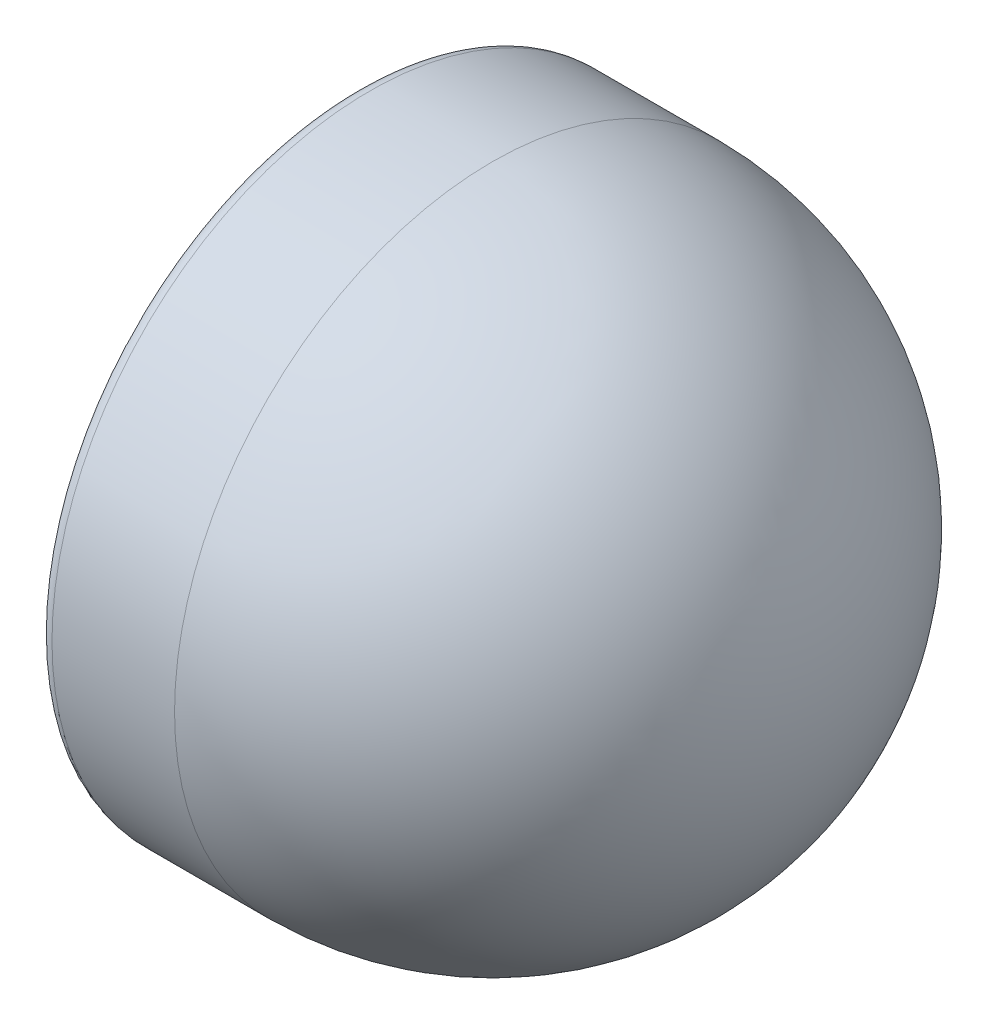
ISO-10303-21;
HEADER;
FILE_DESCRIPTION(('STEP AP214'),'2;1');
FILE_NAME('part.step','',(''),(''),'','','');
FILE_SCHEMA(('AUTOMOTIVE_DESIGN { 1 0 10303 214 1 1 1 1 }'));
ENDSEC;
DATA;
#1=APPLICATION_CONTEXT('core data for automotive mechanical design processes');
#2=APPLICATION_PROTOCOL_DEFINITION('international standard','automotive_design',2000,#1);
#3=PRODUCT_CONTEXT('',#1,'mechanical');
#4=PRODUCT('Part','Part','',(#3));
#5=PRODUCT_RELATED_PRODUCT_CATEGORY('part','',(#4));
#6=PRODUCT_DEFINITION_FORMATION('','',#4);
#7=PRODUCT_DEFINITION_CONTEXT('part definition',#1,'design');
#8=PRODUCT_DEFINITION('design','',#6,#7);
#9=PRODUCT_DEFINITION_SHAPE('','',#8);
#10=(LENGTH_UNIT() NAMED_UNIT(*) SI_UNIT(.MILLI.,.METRE.));
#11=(NAMED_UNIT(*) PLANE_ANGLE_UNIT() SI_UNIT($,.RADIAN.));
#12=(NAMED_UNIT(*) SI_UNIT($,.STERADIAN.) SOLID_ANGLE_UNIT());
#13=UNCERTAINTY_MEASURE_WITH_UNIT(LENGTH_MEASURE(1.E-05),#10,'distance_accuracy_value','');
#14=(GEOMETRIC_REPRESENTATION_CONTEXT(3) GLOBAL_UNCERTAINTY_ASSIGNED_CONTEXT((#13)) GLOBAL_UNIT_ASSIGNED_CONTEXT((#10,
#11,#12)) REPRESENTATION_CONTEXT('',''));
#15=CARTESIAN_POINT('',(0.,0.,0.));
#16=DIRECTION('',(0.,0.,1.));
#17=DIRECTION('',(1.,0.,0.));
#18=AXIS2_PLACEMENT_3D('',#15,#16,#17);
#19=CARTESIAN_POINT('',(-70.,0.,0.));
#20=DIRECTION('',(-1.,0.,0.));
#21=DIRECTION('',(0.,1.,0.));
#22=AXIS2_PLACEMENT_3D('',#19,#20,#21);
#23=SPHERICAL_SURFACE('',#22,70.);
#24=CARTESIAN_POINT('',(-70.,0.,0.));
#25=DIRECTION('',(-1.,0.,0.));
#26=DIRECTION('',(0.,0.,1.));
#27=AXIS2_PLACEMENT_3D('',#24,#25,#26);
#28=CIRCLE('',#27,70.);
#29=CARTESIAN_POINT('',(-70.,0.,70.));
#30=VERTEX_POINT('',#29);
#31=EDGE_CURVE('E10',#30,#30,#28,.T.);
#32=ORIENTED_EDGE('',*,*,#31,.F.);
#33=EDGE_LOOP('',(#32));
#34=FACE_BOUND('',#33,.T.);
#35=ADVANCED_FACE('F39',(#34),#23,.T.);
#36=CARTESIAN_POINT('',(-70.,0.,0.));
#37=DIRECTION('',(-1.,0.,0.));
#38=DIRECTION('',(0.,0.,1.));
#39=AXIS2_PLACEMENT_3D('',#36,#37,#38);
#40=CYLINDRICAL_SURFACE('',#39,70.);
#41=CARTESIAN_POINT('',(-97.,0.,0.));
#42=DIRECTION('',(-1.,0.,0.));
#43=DIRECTION('',(0.,0.,1.));
#44=AXIS2_PLACEMENT_3D('',#41,#42,#43);
#45=CIRCLE('',#44,70.);
#46=CARTESIAN_POINT('',(-97.,0.,70.));
#47=VERTEX_POINT('',#46);
#48=EDGE_CURVE('E46',#47,#47,#45,.T.);
#49=ORIENTED_EDGE('',*,*,#48,.F.);
#50=EDGE_LOOP('',(#49));
#51=FACE_BOUND('',#50,.T.);
#52=ORIENTED_EDGE('',*,*,#31,.T.);
#53=EDGE_LOOP('',(#52));
#54=FACE_BOUND('',#53,.T.);
#55=ADVANCED_FACE('F203',(#51,#54),#40,.T.);
#56=CARTESIAN_POINT('',(-97.,0.,0.));
#57=DIRECTION('',(-1.,0.,0.));
#58=DIRECTION('',(0.,0.,1.));
#59=AXIS2_PLACEMENT_3D('',#56,#57,#58);
#60=TOROIDAL_SURFACE('',#59,67.,3.);
#61=CARTESIAN_POINT('',(-100.,0.,0.));
#62=DIRECTION('',(-1.,0.,0.));
#63=DIRECTION('',(0.,0.,1.));
#64=AXIS2_PLACEMENT_3D('',#61,#62,#63);
#65=CIRCLE('',#64,67.);
#66=CARTESIAN_POINT('',(-100.,0.,67.));
#67=VERTEX_POINT('',#66);
#68=EDGE_CURVE('E51',#67,#67,#65,.T.);
#69=ORIENTED_EDGE('',*,*,#68,.F.);
#70=EDGE_LOOP('',(#69));
#71=FACE_BOUND('',#70,.T.);
#72=ORIENTED_EDGE('',*,*,#48,.T.);
#73=EDGE_LOOP('',(#72));
#74=FACE_BOUND('',#73,.T.);
#75=ADVANCED_FACE('F198',(#71,#74),#60,.T.);
#76=CARTESIAN_POINT('',(-100.,67.,0.));
#77=DIRECTION('',(1.,0.,0.));
#78=DIRECTION('',(0.,0.,-1.));
#79=AXIS2_PLACEMENT_3D('',#76,#77,#78);
#80=PLANE('',#79);
#81=CARTESIAN_POINT('',(-100.,0.,0.));
#82=DIRECTION('',(-1.,0.,0.));
#83=DIRECTION('',(0.,0.,1.));
#84=AXIS2_PLACEMENT_3D('',#81,#82,#83);
#85=CIRCLE('',#84,61.5);
#86=CARTESIAN_POINT('',(-100.,0.,61.5));
#87=VERTEX_POINT('',#86);
#88=EDGE_CURVE('E56',#87,#87,#85,.T.);
#89=ORIENTED_EDGE('',*,*,#88,.F.);
#90=EDGE_LOOP('',(#89));
#91=FACE_BOUND('',#90,.T.);
#92=ORIENTED_EDGE('',*,*,#68,.T.);
#93=EDGE_LOOP('',(#92));
#94=FACE_BOUND('',#93,.T.);
#95=ADVANCED_FACE('F192',(#91,#94),#80,.F.);
#96=CARTESIAN_POINT('',(-98.5,0.,0.));
#97=DIRECTION('',(-1.,0.,0.));
#98=DIRECTION('',(0.,0.,1.));
#99=AXIS2_PLACEMENT_3D('',#96,#97,#98);
#100=TOROIDAL_SURFACE('',#99,61.5,1.5);
#101=CARTESIAN_POINT('',(-98.5,0.,0.));
#102=DIRECTION('',(-1.,0.,0.));
#103=DIRECTION('',(0.,0.,1.));
#104=AXIS2_PLACEMENT_3D('',#101,#102,#103);
#105=CIRCLE('',#104,60.);
#106=CARTESIAN_POINT('',(-98.5,0.,60.));
#107=VERTEX_POINT('',#106);
#108=EDGE_CURVE('E62',#107,#107,#105,.T.);
#109=ORIENTED_EDGE('',*,*,#108,.F.);
#110=EDGE_LOOP('',(#109));
#111=FACE_BOUND('',#110,.T.);
#112=ORIENTED_EDGE('',*,*,#88,.T.);
#113=EDGE_LOOP('',(#112));
#114=FACE_BOUND('',#113,.T.);
#115=ADVANCED_FACE('F186',(#111,#114),#100,.T.);
#116=CARTESIAN_POINT('',(-70.,0.,0.));
#117=DIRECTION('',(-1.,0.,0.));
#118=DIRECTION('',(0.,0.,1.));
#119=AXIS2_PLACEMENT_3D('',#116,#117,#118);
#120=CYLINDRICAL_SURFACE('',#119,60.);
#121=CARTESIAN_POINT('',(-96.6213203435597,0.,0.));
#122=DIRECTION('',(-1.,0.,0.));
#123=DIRECTION('',(0.,0.,1.));
#124=AXIS2_PLACEMENT_3D('',#121,#122,#123);
#125=CIRCLE('',#124,60.);
#126=CARTESIAN_POINT('',(-96.6213203435597,0.,60.));
#127=VERTEX_POINT('',#126);
#128=EDGE_CURVE('E66',#127,#127,#125,.T.);
#129=ORIENTED_EDGE('',*,*,#128,.F.);
#130=EDGE_LOOP('',(#129));
#131=FACE_BOUND('',#130,.T.);
#132=ORIENTED_EDGE('',*,*,#108,.T.);
#133=EDGE_LOOP('',(#132));
#134=FACE_BOUND('',#133,.T.);
#135=ADVANCED_FACE('F180',(#131,#134),#120,.F.);
#136=CARTESIAN_POINT('',(-96.6213203435597,0.,0.));
#137=DIRECTION('',(-1.,0.,0.));
#138=DIRECTION('',(0.,0.,1.));
#139=AXIS2_PLACEMENT_3D('',#136,#137,#138);
#140=TOROIDAL_SURFACE('',#139,61.5,1.5);
#141=CARTESIAN_POINT('',(-95.5606601717798,0.,0.));
#142=DIRECTION('',(-1.,0.,0.));
#143=DIRECTION('',(0.,0.,1.));
#144=AXIS2_PLACEMENT_3D('',#141,#142,#143);
#145=CIRCLE('',#144,60.4393398282202);
#146=CARTESIAN_POINT('',(-95.5606601717798,0.,60.4393398282202));
#147=VERTEX_POINT('',#146);
#148=EDGE_CURVE('E70',#147,#147,#145,.T.);
#149=ORIENTED_EDGE('',*,*,#148,.F.);
#150=EDGE_LOOP('',(#149));
#151=FACE_BOUND('',#150,.T.);
#152=ORIENTED_EDGE('',*,*,#128,.T.);
#153=EDGE_LOOP('',(#152));
#154=FACE_BOUND('',#153,.T.);
#155=ADVANCED_FACE('F174',(#151,#154),#140,.T.);
#156=CARTESIAN_POINT('',(-95.5606601717798,0.,0.));
#157=DIRECTION('',(1.,0.,0.));
#158=DIRECTION('',(0.,0.,-1.));
#159=AXIS2_PLACEMENT_3D('',#156,#157,#158);
#160=CONICAL_SURFACE('',#159,60.4393398282202,0.78539816339745);
#161=CARTESIAN_POINT('',(-92.,0.,0.));
#162=DIRECTION('',(-1.,0.,0.));
#163=DIRECTION('',(0.,0.,1.));
#164=AXIS2_PLACEMENT_3D('',#161,#162,#163);
#165=CIRCLE('',#164,64.0000000000001);
#166=CARTESIAN_POINT('',(-92.,0.,64.0000000000001));
#167=VERTEX_POINT('',#166);
#168=EDGE_CURVE('E74',#167,#167,#165,.T.);
#169=ORIENTED_EDGE('',*,*,#168,.F.);
#170=EDGE_LOOP('',(#169));
#171=FACE_BOUND('',#170,.T.);
#172=ORIENTED_EDGE('',*,*,#148,.T.);
#173=EDGE_LOOP('',(#172));
#174=FACE_BOUND('',#173,.T.);
#175=ADVANCED_FACE('F168',(#171,#174),#160,.F.);
#176=CARTESIAN_POINT('',(-92.,64.0000000000001,0.));
#177=DIRECTION('',(-1.,0.,0.));
#178=DIRECTION('',(0.,0.,1.));
#179=AXIS2_PLACEMENT_3D('',#176,#177,#178);
#180=PLANE('',#179);
#181=CARTESIAN_POINT('',(-92.,0.,0.));
#182=DIRECTION('',(-1.,0.,0.));
#183=DIRECTION('',(0.,0.,1.));
#184=AXIS2_PLACEMENT_3D('',#181,#182,#183);
#185=CIRCLE('',#184,64.7071067811866);
#186=CARTESIAN_POINT('',(-92.,0.,64.7071067811866));
#187=VERTEX_POINT('',#186);
#188=EDGE_CURVE('E78',#187,#187,#185,.T.);
#189=ORIENTED_EDGE('',*,*,#188,.F.);
#190=EDGE_LOOP('',(#189));
#191=FACE_BOUND('',#190,.T.);
#192=ORIENTED_EDGE('',*,*,#168,.T.);
#193=EDGE_LOOP('',(#192));
#194=FACE_BOUND('',#193,.T.);
#195=ADVANCED_FACE('F162',(#191,#194),#180,.F.);
#196=CARTESIAN_POINT('',(-70.,0.,0.));
#197=DIRECTION('',(-1.,0.,0.));
#198=DIRECTION('',(0.,0.,1.));
#199=AXIS2_PLACEMENT_3D('',#196,#197,#198);
#200=CYLINDRICAL_SURFACE('',#199,64.7071067811866);
#201=CARTESIAN_POINT('',(-92.7071067811865,0.,0.));
#202=DIRECTION('',(-1.,0.,0.));
#203=DIRECTION('',(0.,0.,1.));
#204=AXIS2_PLACEMENT_3D('',#201,#202,#203);
#205=CIRCLE('',#204,64.7071067811866);
#206=CARTESIAN_POINT('',(-92.7071067811865,0.,64.7071067811866));
#207=VERTEX_POINT('',#206);
#208=EDGE_CURVE('E82',#207,#207,#205,.T.);
#209=ORIENTED_EDGE('',*,*,#208,.F.);
#210=EDGE_LOOP('',(#209));
#211=FACE_BOUND('',#210,.T.);
#212=ORIENTED_EDGE('',*,*,#188,.T.);
#213=EDGE_LOOP('',(#212));
#214=FACE_BOUND('',#213,.T.);
#215=ADVANCED_FACE('F156',(#211,#214),#200,.T.);
#216=CARTESIAN_POINT('',(-92.7071067811865,0.,0.));
#217=DIRECTION('',(1.,0.,0.));
#218=DIRECTION('',(0.,0.,-1.));
#219=AXIS2_PLACEMENT_3D('',#216,#217,#218);
#220=CONICAL_SURFACE('',#219,64.7071067811866,0.785398163397448);
#221=CARTESIAN_POINT('',(-96.2677669529664,0.,0.));
#222=DIRECTION('',(-1.,0.,0.));
#223=DIRECTION('',(0.,0.,1.));
#224=AXIS2_PLACEMENT_3D('',#221,#222,#223);
#225=CIRCLE('',#224,61.1464466094068);
#226=CARTESIAN_POINT('',(-96.2677669529664,0.,61.1464466094068));
#227=VERTEX_POINT('',#226);
#228=EDGE_CURVE('E86',#227,#227,#225,.T.);
#229=ORIENTED_EDGE('',*,*,#228,.F.);
#230=EDGE_LOOP('',(#229));
#231=FACE_BOUND('',#230,.T.);
#232=ORIENTED_EDGE('',*,*,#208,.T.);
#233=EDGE_LOOP('',(#232));
#234=FACE_BOUND('',#233,.T.);
#235=ADVANCED_FACE('F150',(#231,#234),#220,.T.);
#236=CARTESIAN_POINT('',(-96.6213203435597,0.,0.));
#237=DIRECTION('',(-1.,0.,0.));
#238=DIRECTION('',(0.,0.,1.));
#239=AXIS2_PLACEMENT_3D('',#236,#237,#238);
#240=TOROIDAL_SURFACE('',#239,61.5,0.500000000000003);
#241=CARTESIAN_POINT('',(-96.6213203435597,0.,0.));
#242=DIRECTION('',(-1.,0.,0.));
#243=DIRECTION('',(0.,0.,1.));
#244=AXIS2_PLACEMENT_3D('',#241,#242,#243);
#245=CIRCLE('',#244,61.);
#246=CARTESIAN_POINT('',(-96.6213203435597,0.,61.));
#247=VERTEX_POINT('',#246);
#248=EDGE_CURVE('E90',#247,#247,#245,.T.);
#249=ORIENTED_EDGE('',*,*,#248,.F.);
#250=EDGE_LOOP('',(#249));
#251=FACE_BOUND('',#250,.T.);
#252=ORIENTED_EDGE('',*,*,#228,.T.);
#253=EDGE_LOOP('',(#252));
#254=FACE_BOUND('',#253,.T.);
#255=ADVANCED_FACE('F144',(#251,#254),#240,.F.);
#256=CARTESIAN_POINT('',(-70.,0.,0.));
#257=DIRECTION('',(-1.,0.,0.));
#258=DIRECTION('',(0.,0.,1.));
#259=AXIS2_PLACEMENT_3D('',#256,#257,#258);
#260=CYLINDRICAL_SURFACE('',#259,61.);
#261=CARTESIAN_POINT('',(-98.5,0.,0.));
#262=DIRECTION('',(-1.,0.,0.));
#263=DIRECTION('',(0.,0.,1.));
#264=AXIS2_PLACEMENT_3D('',#261,#262,#263);
#265=CIRCLE('',#264,61.);
#266=CARTESIAN_POINT('',(-98.5,0.,61.));
#267=VERTEX_POINT('',#266);
#268=EDGE_CURVE('E94',#267,#267,#265,.T.);
#269=ORIENTED_EDGE('',*,*,#268,.F.);
#270=EDGE_LOOP('',(#269));
#271=FACE_BOUND('',#270,.T.);
#272=ORIENTED_EDGE('',*,*,#248,.T.);
#273=EDGE_LOOP('',(#272));
#274=FACE_BOUND('',#273,.T.);
#275=ADVANCED_FACE('F138',(#271,#274),#260,.T.);
#276=CARTESIAN_POINT('',(-98.5,0.,0.));
#277=DIRECTION('',(-1.,0.,0.));
#278=DIRECTION('',(0.,0.,1.));
#279=AXIS2_PLACEMENT_3D('',#276,#277,#278);
#280=TOROIDAL_SURFACE('',#279,61.5,0.499999999999994);
#281=CARTESIAN_POINT('',(-99.,0.,0.));
#282=DIRECTION('',(-1.,0.,0.));
#283=DIRECTION('',(0.,0.,1.));
#284=AXIS2_PLACEMENT_3D('',#281,#282,#283);
#285=CIRCLE('',#284,61.5);
#286=CARTESIAN_POINT('',(-99.,0.,61.5));
#287=VERTEX_POINT('',#286);
#288=EDGE_CURVE('E98',#287,#287,#285,.T.);
#289=ORIENTED_EDGE('',*,*,#288,.F.);
#290=EDGE_LOOP('',(#289));
#291=FACE_BOUND('',#290,.T.);
#292=ORIENTED_EDGE('',*,*,#268,.T.);
#293=EDGE_LOOP('',(#292));
#294=FACE_BOUND('',#293,.T.);
#295=ADVANCED_FACE('F132',(#291,#294),#280,.F.);
#296=CARTESIAN_POINT('',(-99.,67.,0.));
#297=DIRECTION('',(-1.,0.,0.));
#298=DIRECTION('',(0.,0.,1.));
#299=AXIS2_PLACEMENT_3D('',#296,#297,#298);
#300=PLANE('',#299);
#301=CARTESIAN_POINT('',(-99.,0.,0.));
#302=DIRECTION('',(-1.,0.,0.));
#303=DIRECTION('',(0.,0.,1.));
#304=AXIS2_PLACEMENT_3D('',#301,#302,#303);
#305=CIRCLE('',#304,67.);
#306=CARTESIAN_POINT('',(-99.,0.,67.));
#307=VERTEX_POINT('',#306);
#308=EDGE_CURVE('E102',#307,#307,#305,.T.);
#309=ORIENTED_EDGE('',*,*,#308,.F.);
#310=EDGE_LOOP('',(#309));
#311=FACE_BOUND('',#310,.T.);
#312=ORIENTED_EDGE('',*,*,#288,.T.);
#313=EDGE_LOOP('',(#312));
#314=FACE_BOUND('',#313,.T.);
#315=ADVANCED_FACE('F126',(#311,#314),#300,.F.);
#316=CARTESIAN_POINT('',(-97.,0.,0.));
#317=DIRECTION('',(-1.,0.,0.));
#318=DIRECTION('',(0.,0.,1.));
#319=AXIS2_PLACEMENT_3D('',#316,#317,#318);
#320=TOROIDAL_SURFACE('',#319,67.,1.99999999999999);
#321=CARTESIAN_POINT('',(-97.,0.,0.));
#322=DIRECTION('',(-1.,0.,0.));
#323=DIRECTION('',(0.,0.,1.));
#324=AXIS2_PLACEMENT_3D('',#321,#322,#323);
#325=CIRCLE('',#324,69.);
#326=CARTESIAN_POINT('',(-97.,0.,69.));
#327=VERTEX_POINT('',#326);
#328=EDGE_CURVE('E106',#327,#327,#325,.T.);
#329=ORIENTED_EDGE('',*,*,#328,.F.);
#330=EDGE_LOOP('',(#329));
#331=FACE_BOUND('',#330,.T.);
#332=ORIENTED_EDGE('',*,*,#308,.T.);
#333=EDGE_LOOP('',(#332));
#334=FACE_BOUND('',#333,.T.);
#335=ADVANCED_FACE('F120',(#331,#334),#320,.F.);
#336=CARTESIAN_POINT('',(-70.,0.,0.));
#337=DIRECTION('',(-1.,0.,0.));
#338=DIRECTION('',(0.,0.,1.));
#339=AXIS2_PLACEMENT_3D('',#336,#337,#338);
#340=CYLINDRICAL_SURFACE('',#339,69.);
#341=CARTESIAN_POINT('',(-70.,0.,0.));
#342=DIRECTION('',(-1.,0.,0.));
#343=DIRECTION('',(0.,0.,1.));
#344=AXIS2_PLACEMENT_3D('',#341,#342,#343);
#345=CIRCLE('',#344,69.);
#346=CARTESIAN_POINT('',(-70.,0.,69.));
#347=VERTEX_POINT('',#346);
#348=EDGE_CURVE('E110',#347,#347,#345,.T.);
#349=ORIENTED_EDGE('',*,*,#348,.F.);
#350=EDGE_LOOP('',(#349));
#351=FACE_BOUND('',#350,.T.);
#352=ORIENTED_EDGE('',*,*,#328,.T.);
#353=EDGE_LOOP('',(#352));
#354=FACE_BOUND('',#353,.T.);
#355=ADVANCED_FACE('F117',(#351,#354),#340,.F.);
#356=CARTESIAN_POINT('',(-70.,0.,0.));
#357=DIRECTION('',(-1.,0.,0.));
#358=DIRECTION('',(0.,1.,0.));
#359=AXIS2_PLACEMENT_3D('',#356,#357,#358);
#360=SPHERICAL_SURFACE('',#359,69.);
#361=ORIENTED_EDGE('',*,*,#348,.T.);
#362=EDGE_LOOP('',(#361));
#363=FACE_BOUND('',#362,.T.);
#364=ADVANCED_FACE('F115',(#363),#360,.F.);
#365=CLOSED_SHELL('',(#35,#55,#75,#95,#115,#135,#155,#175,#195,#215,#235,#255,#275,#295,#315,
#335,#355,#364));
#366=MANIFOLD_SOLID_BREP('B2',#365);
#367=ADVANCED_BREP_SHAPE_REPRESENTATION('',(#18,#366),#14);
#368=SHAPE_DEFINITION_REPRESENTATION(#9,#367);
ENDSEC;
END-ISO-10303-21;
